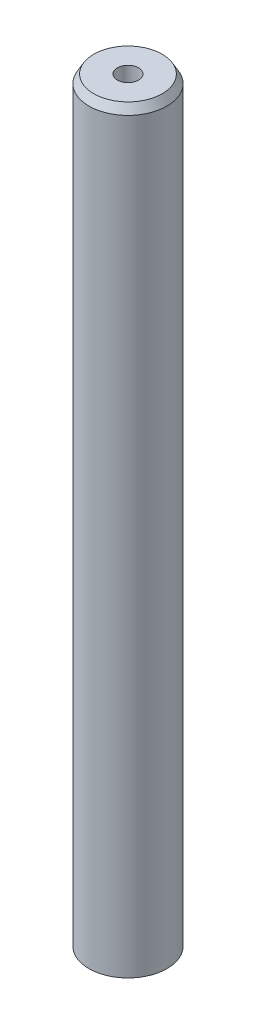
ISO-10303-21;
HEADER;
FILE_DESCRIPTION(('STEP AP214'),'2;1');
FILE_NAME('part.step','',(''),(''),'','','');
FILE_SCHEMA(('AUTOMOTIVE_DESIGN { 1 0 10303 214 1 1 1 1 }'));
ENDSEC;
DATA;
#1=APPLICATION_CONTEXT('core data for automotive mechanical design processes');
#2=APPLICATION_PROTOCOL_DEFINITION('international standard','automotive_design',2000,#1);
#3=PRODUCT_CONTEXT('',#1,'mechanical');
#4=PRODUCT('Part','Part','',(#3));
#5=PRODUCT_RELATED_PRODUCT_CATEGORY('part','',(#4));
#6=PRODUCT_DEFINITION_FORMATION('','',#4);
#7=PRODUCT_DEFINITION_CONTEXT('part definition',#1,'design');
#8=PRODUCT_DEFINITION('design','',#6,#7);
#9=PRODUCT_DEFINITION_SHAPE('','',#8);
#10=(LENGTH_UNIT() NAMED_UNIT(*) SI_UNIT(.MILLI.,.METRE.));
#11=(NAMED_UNIT(*) PLANE_ANGLE_UNIT() SI_UNIT($,.RADIAN.));
#12=(NAMED_UNIT(*) SI_UNIT($,.STERADIAN.) SOLID_ANGLE_UNIT());
#13=UNCERTAINTY_MEASURE_WITH_UNIT(LENGTH_MEASURE(1.E-05),#10,'distance_accuracy_value','');
#14=(GEOMETRIC_REPRESENTATION_CONTEXT(3) GLOBAL_UNCERTAINTY_ASSIGNED_CONTEXT((#13)) GLOBAL_UNIT_ASSIGNED_CONTEXT((#10,
#11,#12)) REPRESENTATION_CONTEXT('',''));
#15=CARTESIAN_POINT('',(0.,0.,0.));
#16=DIRECTION('',(0.,0.,1.));
#17=DIRECTION('',(1.,0.,0.));
#18=AXIS2_PLACEMENT_3D('',#15,#16,#17);
#19=CARTESIAN_POINT('',(0.,243.666036296154,0.));
#20=DIRECTION('',(0.,-1.,0.));
#21=DIRECTION('',(0.,0.,-1.));
#22=AXIS2_PLACEMENT_3D('',#19,#20,#21);
#23=CYLINDRICAL_SURFACE('',#22,12.5);
#24=CARTESIAN_POINT('',(0.,240.990720449412,0.));
#25=DIRECTION('',(0.,1.,0.));
#26=DIRECTION('',(0.,0.,1.));
#27=AXIS2_PLACEMENT_3D('',#24,#25,#26);
#28=CIRCLE('',#27,12.5);
#29=CARTESIAN_POINT('',(0.,240.990720449412,12.5));
#30=VERTEX_POINT('',#29);
#31=EDGE_CURVE('E50',#30,#30,#28,.F.);
#32=ORIENTED_EDGE('',*,*,#31,.T.);
#33=EDGE_LOOP('',(#32));
#34=FACE_BOUND('',#33,.T.);
#35=CARTESIAN_POINT('',(0.,1.52265645849448,0.));
#36=DIRECTION('',(0.,1.,0.));
#37=DIRECTION('',(0.,0.,1.));
#38=AXIS2_PLACEMENT_3D('',#35,#36,#37);
#39=CIRCLE('',#38,12.5);
#40=CARTESIAN_POINT('',(0.,1.52265645849448,12.5));
#41=VERTEX_POINT('',#40);
#42=EDGE_CURVE('E51',#41,#41,#39,.T.);
#43=ORIENTED_EDGE('',*,*,#42,.T.);
#44=EDGE_LOOP('',(#43));
#45=FACE_BOUND('',#44,.T.);
#46=ADVANCED_FACE('F39',(#34,#45),#23,.T.);
#47=CARTESIAN_POINT('',(0.,243.666036296154,0.));
#48=DIRECTION('',(0.,1.,0.));
#49=DIRECTION('',(0.,0.,1.));
#50=AXIS2_PLACEMENT_3D('',#47,#48,#49);
#51=PLANE('',#50);
#52=CARTESIAN_POINT('',(0.,243.666036296154,0.));
#53=DIRECTION('',(0.,1.,0.));
#54=DIRECTION('',(0.,0.,1.));
#55=AXIS2_PLACEMENT_3D('',#52,#53,#54);
#56=CIRCLE('',#55,10.9773435415055);
#57=CARTESIAN_POINT('',(0.,243.666036296154,10.9773435415055));
#58=VERTEX_POINT('',#57);
#59=EDGE_CURVE('E54',#58,#58,#56,.T.);
#60=ORIENTED_EDGE('',*,*,#59,.T.);
#61=EDGE_LOOP('',(#60));
#62=FACE_BOUND('',#61,.T.);
#63=CARTESIAN_POINT('',(0.,243.666036296154,0.));
#64=DIRECTION('',(0.,1.,0.));
#65=DIRECTION('',(0.,0.,1.));
#66=AXIS2_PLACEMENT_3D('',#63,#64,#65);
#67=CIRCLE('',#66,3.40854528915388);
#68=CARTESIAN_POINT('',(0.,243.666036296154,3.40854528915388));
#69=VERTEX_POINT('',#68);
#70=EDGE_CURVE('E58',#69,#69,#67,.T.);
#71=ORIENTED_EDGE('',*,*,#70,.F.);
#72=EDGE_LOOP('',(#71));
#73=FACE_BOUND('',#72,.T.);
#74=ADVANCED_FACE('F69',(#62,#73),#51,.T.);
#75=CARTESIAN_POINT('',(0.,0.,0.));
#76=DIRECTION('',(0.,1.,0.));
#77=DIRECTION('',(0.,0.,1.));
#78=AXIS2_PLACEMENT_3D('',#75,#76,#77);
#79=PLANE('',#78);
#80=CARTESIAN_POINT('',(0.,0.,0.));
#81=DIRECTION('',(0.,1.,0.));
#82=DIRECTION('',(0.,0.,1.));
#83=AXIS2_PLACEMENT_3D('',#80,#81,#82);
#84=CIRCLE('',#83,9.82468415325732);
#85=CARTESIAN_POINT('',(0.,0.,9.82468415325732));
#86=VERTEX_POINT('',#85);
#87=EDGE_CURVE('E10',#86,#86,#84,.F.);
#88=ORIENTED_EDGE('',*,*,#87,.T.);
#89=EDGE_LOOP('',(#88));
#90=FACE_BOUND('',#89,.T.);
#91=CARTESIAN_POINT('',(0.,0.,0.));
#92=DIRECTION('',(0.,1.,0.));
#93=DIRECTION('',(0.,0.,1.));
#94=AXIS2_PLACEMENT_3D('',#91,#92,#93);
#95=CIRCLE('',#94,3.40854528915388);
#96=CARTESIAN_POINT('',(0.,0.,3.40854528915388));
#97=VERTEX_POINT('',#96);
#98=EDGE_CURVE('E63',#97,#97,#95,.T.);
#99=ORIENTED_EDGE('',*,*,#98,.T.);
#100=EDGE_LOOP('',(#99));
#101=FACE_BOUND('',#100,.T.);
#102=ADVANCED_FACE('F75',(#90,#101),#79,.F.);
#103=CARTESIAN_POINT('',(0.,243.666036296154,0.));
#104=DIRECTION('',(0.,-1.,0.));
#105=DIRECTION('',(0.,0.,-1.));
#106=AXIS2_PLACEMENT_3D('',#103,#104,#105);
#107=CYLINDRICAL_SURFACE('',#106,3.40854528915388);
#108=ORIENTED_EDGE('',*,*,#70,.T.);
#109=EDGE_LOOP('',(#108));
#110=FACE_BOUND('',#109,.T.);
#111=ORIENTED_EDGE('',*,*,#98,.F.);
#112=EDGE_LOOP('',(#111));
#113=FACE_BOUND('',#112,.T.);
#114=ADVANCED_FACE('F70',(#110,#113),#107,.F.);
#115=CARTESIAN_POINT('',(0.,243.666036296154,0.));
#116=DIRECTION('',(0.,-1.,0.));
#117=DIRECTION('',(0.,0.,-1.));
#118=AXIS2_PLACEMENT_3D('',#115,#116,#117);
#119=CONICAL_SURFACE('',#118,10.9773435415055,0.517426861441369);
#120=ORIENTED_EDGE('',*,*,#31,.F.);
#121=EDGE_LOOP('',(#120));
#122=FACE_BOUND('',#121,.T.);
#123=ORIENTED_EDGE('',*,*,#59,.F.);
#124=EDGE_LOOP('',(#123));
#125=FACE_BOUND('',#124,.T.);
#126=ADVANCED_FACE('F81',(#122,#125),#119,.T.);
#127=CARTESIAN_POINT('',(0.,1.52265645849448,0.));
#128=DIRECTION('',(0.,1.,0.));
#129=DIRECTION('',(0.,0.,1.));
#130=AXIS2_PLACEMENT_3D('',#127,#128,#129);
#131=CONICAL_SURFACE('',#130,12.5,1.05336946535352);
#132=ORIENTED_EDGE('',*,*,#87,.F.);
#133=EDGE_LOOP('',(#132));
#134=FACE_BOUND('',#133,.T.);
#135=ORIENTED_EDGE('',*,*,#42,.F.);
#136=EDGE_LOOP('',(#135));
#137=FACE_BOUND('',#136,.T.);
#138=ADVANCED_FACE('F45',(#134,#137),#131,.T.);
#139=CLOSED_SHELL('',(#46,#74,#102,#114,#126,#138));
#140=MANIFOLD_SOLID_BREP('B2',#139);
#141=ADVANCED_BREP_SHAPE_REPRESENTATION('',(#18,#140),#14);
#142=SHAPE_DEFINITION_REPRESENTATION(#9,#141);
ENDSEC;
END-ISO-10303-21;
